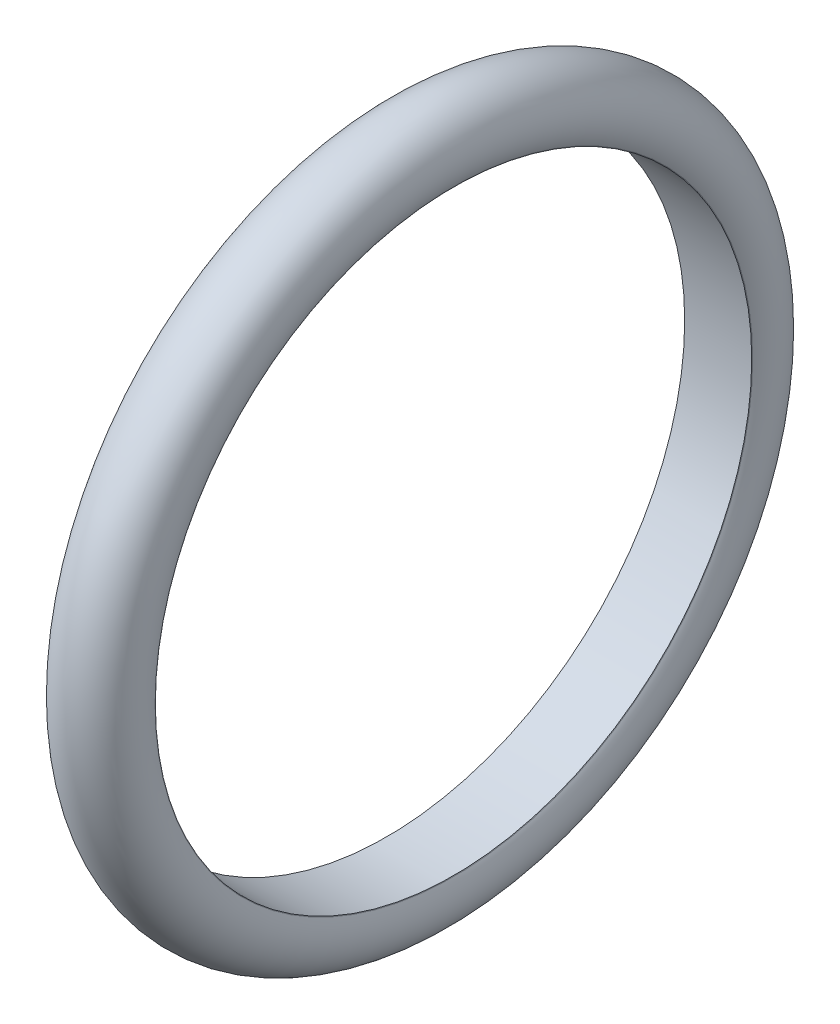
ISO-10303-21;
HEADER;
FILE_DESCRIPTION(('STEP AP214'),'2;1');
FILE_NAME('part.step','',(''),(''),'','','');
FILE_SCHEMA(('AUTOMOTIVE_DESIGN { 1 0 10303 214 1 1 1 1 }'));
ENDSEC;
DATA;
#1=APPLICATION_CONTEXT('core data for automotive mechanical design processes');
#2=APPLICATION_PROTOCOL_DEFINITION('international standard','automotive_design',2000,#1);
#3=PRODUCT_CONTEXT('',#1,'mechanical');
#4=PRODUCT('Part','Part','',(#3));
#5=PRODUCT_RELATED_PRODUCT_CATEGORY('part','',(#4));
#6=PRODUCT_DEFINITION_FORMATION('','',#4);
#7=PRODUCT_DEFINITION_CONTEXT('part definition',#1,'design');
#8=PRODUCT_DEFINITION('design','',#6,#7);
#9=PRODUCT_DEFINITION_SHAPE('','',#8);
#10=(LENGTH_UNIT() NAMED_UNIT(*) SI_UNIT(.MILLI.,.METRE.));
#11=(NAMED_UNIT(*) PLANE_ANGLE_UNIT() SI_UNIT($,.RADIAN.));
#12=(NAMED_UNIT(*) SI_UNIT($,.STERADIAN.) SOLID_ANGLE_UNIT());
#13=UNCERTAINTY_MEASURE_WITH_UNIT(LENGTH_MEASURE(1.E-05),#10,'distance_accuracy_value','');
#14=(GEOMETRIC_REPRESENTATION_CONTEXT(3) GLOBAL_UNCERTAINTY_ASSIGNED_CONTEXT((#13)) GLOBAL_UNIT_ASSIGNED_CONTEXT((#10,
#11,#12)) REPRESENTATION_CONTEXT('',''));
#15=CARTESIAN_POINT('',(0.,0.,0.));
#16=DIRECTION('',(0.,0.,1.));
#17=DIRECTION('',(1.,0.,0.));
#18=AXIS2_PLACEMENT_3D('',#15,#16,#17);
#19=CARTESIAN_POINT('',(0.,0.,0.));
#20=DIRECTION('',(-1.,0.,0.));
#21=DIRECTION('',(0.,0.,1.));
#22=AXIS2_PLACEMENT_3D('',#19,#20,#21);
#23=TOROIDAL_SURFACE('',#22,180.975,22.225);
#24=CARTESIAN_POINT('',(-19.2474145991092,0.,0.));
#25=DIRECTION('',(-1.,0.,0.));
#26=DIRECTION('',(0.,0.,1.));
#27=AXIS2_PLACEMENT_3D('',#24,#25,#26);
#28=CIRCLE('',#27,169.8625);
#29=CARTESIAN_POINT('',(-19.2474145991092,0.,169.8625));
#30=VERTEX_POINT('',#29);
#31=EDGE_CURVE('E50',#30,#30,#28,.T.);
#32=ORIENTED_EDGE('',*,*,#31,.F.);
#33=EDGE_LOOP('',(#32));
#34=FACE_BOUND('',#33,.T.);
#35=CARTESIAN_POINT('',(19.2474145991092,0.,0.));
#36=DIRECTION('',(-1.,0.,0.));
#37=DIRECTION('',(0.,0.,1.));
#38=AXIS2_PLACEMENT_3D('',#35,#36,#37);
#39=CIRCLE('',#38,169.8625);
#40=CARTESIAN_POINT('',(19.2474145991092,0.,169.8625));
#41=VERTEX_POINT('',#40);
#42=EDGE_CURVE('E12',#41,#41,#39,.T.);
#43=ORIENTED_EDGE('',*,*,#42,.T.);
#44=EDGE_LOOP('',(#43));
#45=FACE_BOUND('',#44,.T.);
#46=ADVANCED_FACE('F36',(#34,#45),#23,.T.);
#47=CARTESIAN_POINT('',(19.05,0.,0.));
#48=DIRECTION('',(1.,0.,0.));
#49=DIRECTION('',(0.,0.,-1.));
#50=AXIS2_PLACEMENT_3D('',#47,#48,#49);
#51=CONICAL_SURFACE('',#50,169.520567884187,1.04719755119659);
#52=ORIENTED_EDGE('',*,*,#42,.F.);
#53=EDGE_LOOP('',(#52));
#54=FACE_BOUND('',#53,.T.);
#55=CARTESIAN_POINT('',(19.05,0.,0.));
#56=DIRECTION('',(-1.,0.,0.));
#57=DIRECTION('',(0.,0.,1.));
#58=AXIS2_PLACEMENT_3D('',#55,#56,#57);
#59=CIRCLE('',#58,169.520567884187);
#60=CARTESIAN_POINT('',(19.05,0.,169.520567884187));
#61=VERTEX_POINT('',#60);
#62=EDGE_CURVE('E42',#61,#61,#59,.T.);
#63=ORIENTED_EDGE('',*,*,#62,.T.);
#64=EDGE_LOOP('',(#63));
#65=FACE_BOUND('',#64,.T.);
#66=ADVANCED_FACE('F59',(#54,#65),#51,.F.);
#67=CARTESIAN_POINT('',(0.,0.,0.));
#68=DIRECTION('',(-1.,0.,0.));
#69=DIRECTION('',(0.,0.,1.));
#70=AXIS2_PLACEMENT_3D('',#67,#68,#69);
#71=CYLINDRICAL_SURFACE('',#70,169.520567884187);
#72=ORIENTED_EDGE('',*,*,#62,.F.);
#73=EDGE_LOOP('',(#72));
#74=FACE_BOUND('',#73,.T.);
#75=CARTESIAN_POINT('',(-19.05,0.,0.));
#76=DIRECTION('',(-1.,0.,0.));
#77=DIRECTION('',(0.,0.,1.));
#78=AXIS2_PLACEMENT_3D('',#75,#76,#77);
#79=CIRCLE('',#78,169.520567884187);
#80=CARTESIAN_POINT('',(-19.05,0.,169.520567884187));
#81=VERTEX_POINT('',#80);
#82=EDGE_CURVE('E46',#81,#81,#79,.T.);
#83=ORIENTED_EDGE('',*,*,#82,.T.);
#84=EDGE_LOOP('',(#83));
#85=FACE_BOUND('',#84,.T.);
#86=ADVANCED_FACE('F63',(#74,#85),#71,.F.);
#87=CARTESIAN_POINT('',(-19.2474145991092,0.,0.));
#88=DIRECTION('',(-1.,0.,0.));
#89=DIRECTION('',(0.,0.,1.));
#90=AXIS2_PLACEMENT_3D('',#87,#88,#89);
#91=CONICAL_SURFACE('',#90,169.8625,1.04719755119659);
#92=ORIENTED_EDGE('',*,*,#82,.F.);
#93=EDGE_LOOP('',(#92));
#94=FACE_BOUND('',#93,.T.);
#95=ORIENTED_EDGE('',*,*,#31,.T.);
#96=EDGE_LOOP('',(#95));
#97=FACE_BOUND('',#96,.T.);
#98=ADVANCED_FACE('F56',(#94,#97),#91,.F.);
#99=CLOSED_SHELL('',(#46,#66,#86,#98));
#100=MANIFOLD_SOLID_BREP('B2',#99);
#101=ADVANCED_BREP_SHAPE_REPRESENTATION('',(#18,#100),#14);
#102=SHAPE_DEFINITION_REPRESENTATION(#9,#101);
ENDSEC;
END-ISO-10303-21;
